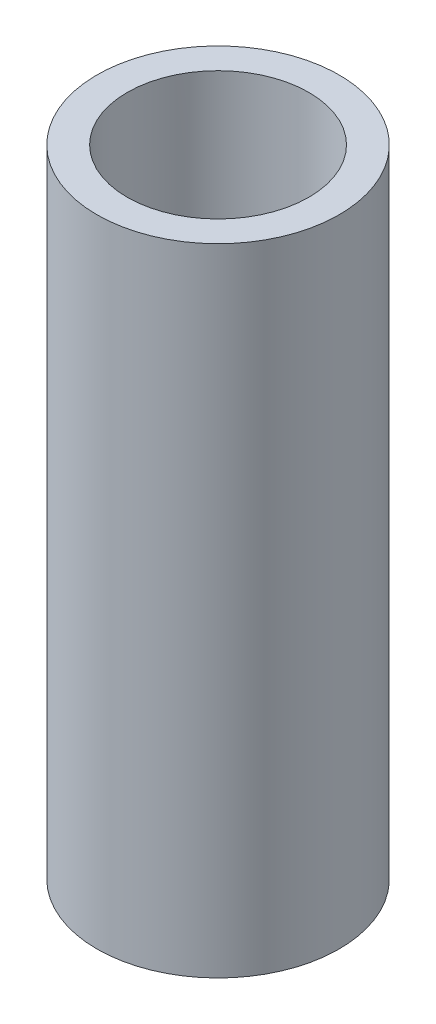
ISO-10303-21;
HEADER;
FILE_DESCRIPTION(('STEP AP214'),'2;1');
FILE_NAME('part.step','',(''),(''),'','','');
FILE_SCHEMA(('AUTOMOTIVE_DESIGN { 1 0 10303 214 1 1 1 1 }'));
ENDSEC;
DATA;
#1=APPLICATION_CONTEXT('core data for automotive mechanical design processes');
#2=APPLICATION_PROTOCOL_DEFINITION('international standard','automotive_design',2000,#1);
#3=PRODUCT_CONTEXT('',#1,'mechanical');
#4=PRODUCT('Part','Part','',(#3));
#5=PRODUCT_RELATED_PRODUCT_CATEGORY('part','',(#4));
#6=PRODUCT_DEFINITION_FORMATION('','',#4);
#7=PRODUCT_DEFINITION_CONTEXT('part definition',#1,'design');
#8=PRODUCT_DEFINITION('design','',#6,#7);
#9=PRODUCT_DEFINITION_SHAPE('','',#8);
#10=(LENGTH_UNIT() NAMED_UNIT(*) SI_UNIT(.MILLI.,.METRE.));
#11=(NAMED_UNIT(*) PLANE_ANGLE_UNIT() SI_UNIT($,.RADIAN.));
#12=(NAMED_UNIT(*) SI_UNIT($,.STERADIAN.) SOLID_ANGLE_UNIT());
#13=UNCERTAINTY_MEASURE_WITH_UNIT(LENGTH_MEASURE(1.E-05),#10,'distance_accuracy_value','');
#14=(GEOMETRIC_REPRESENTATION_CONTEXT(3) GLOBAL_UNCERTAINTY_ASSIGNED_CONTEXT((#13)) GLOBAL_UNIT_ASSIGNED_CONTEXT((#10,
#11,#12)) REPRESENTATION_CONTEXT('',''));
#15=CARTESIAN_POINT('',(0.,0.,0.));
#16=DIRECTION('',(0.,0.,1.));
#17=DIRECTION('',(1.,0.,0.));
#18=AXIS2_PLACEMENT_3D('',#15,#16,#17);
#19=CARTESIAN_POINT('',(0.,21.,0.));
#20=DIRECTION('',(0.,-1.,0.));
#21=DIRECTION('',(0.,0.,-1.));
#22=AXIS2_PLACEMENT_3D('',#19,#20,#21);
#23=CYLINDRICAL_SURFACE('',#22,4.);
#24=DIRECTION('',(0.,-1.,0.));
#25=VECTOR('',#24,1.);
#26=CARTESIAN_POINT('',(-3.99991645107305,21.,-0.0258531320189111));
#27=LINE('',#26,#25);
#28=CARTESIAN_POINT('',(-3.99991645107308,17.399761270919,-0.025853132018911));
#29=VERTEX_POINT('',#28);
#30=CARTESIAN_POINT('',(-3.99991645107308,14.600238729081,-0.025853132018911));
#31=VERTEX_POINT('',#30);
#32=EDGE_CURVE('E11',#29,#31,#27,.T.);
#33=ORIENTED_EDGE('',*,*,#32,.T.);
#34=CARTESIAN_POINT('',(-3.99991645107308,14.600238729081,-0.0258531320190421));
#35=CARTESIAN_POINT('',(-3.99967225830139,14.6009439988238,-0.0640921575293315));
#36=CARTESIAN_POINT('',(-3.99887347610365,14.6032187619792,-0.102278964228953));
#37=CARTESIAN_POINT('',(-3.99620499133585,14.6108738995903,-0.178292419562263));
#38=CARTESIAN_POINT('',(-3.99433556857381,14.6162534626206,-0.216119159673172));
#39=CARTESIAN_POINT('',(-3.98719610185074,14.6369488008378,-0.328422064505284));
#40=CARTESIAN_POINT('',(-3.98039240823535,14.6568271415164,-0.402013757078062));
#41=CARTESIAN_POINT('',(-3.96340813940453,14.7080320373958,-0.544576356502268));
#42=CARTESIAN_POINT('',(-3.95322930854667,14.7393526797706,-0.613549628185836));
#43=CARTESIAN_POINT('',(-3.93052020660311,14.8124834378182,-0.745307835813629));
#44=CARTESIAN_POINT('',(-3.91798857048058,14.8542996475161,-0.808089146927107));
#45=CARTESIAN_POINT('',(-3.89135352945277,14.9489240346771,-0.928050448785724));
#46=CARTESIAN_POINT('',(-3.8772106603566,15.0020634331421,-0.984960294435631));
#47=CARTESIAN_POINT('',(-3.84921378824501,15.1170764566808,-1.08925407411135));
#48=CARTESIAN_POINT('',(-3.83535986056662,15.1789523277724,-1.1366355509169));
#49=CARTESIAN_POINT('',(-3.80908699514521,15.3118854332206,-1.22184578759158));
#50=CARTESIAN_POINT('',(-3.79672101385227,15.3831561146456,-1.2593593716383));
#51=CARTESIAN_POINT('',(-3.77546131742445,15.5315120212514,-1.32173627746362));
#52=CARTESIAN_POINT('',(-3.76656616175619,15.6085948182841,-1.34660484873724));
#53=CARTESIAN_POINT('',(-3.75372261689463,15.7631109656046,-1.38199497149599));
#54=CARTESIAN_POINT('',(-3.74958979642407,15.840405738016,-1.39305292756278));
#55=CARTESIAN_POINT('',(-3.74619639341714,15.9958548095515,-1.40215536416123));
#56=CARTESIAN_POINT('',(-3.74693437342952,16.0740088482956,-1.40020368404321));
#57=CARTESIAN_POINT('',(-3.75302260858192,16.2249354068714,-1.38379454669174));
#58=CARTESIAN_POINT('',(-3.75814713768332,16.2977849538027,-1.36994900946075));
#59=CARTESIAN_POINT('',(-3.77208656020989,16.440062954669,-1.33108421220736));
#60=CARTESIAN_POINT('',(-3.78090196998585,16.5094909284095,-1.30606338874007));
#61=CARTESIAN_POINT('',(-3.8014547569224,16.6446909983725,-1.24498869082329));
#62=CARTESIAN_POINT('',(-3.81325163509311,16.7103504237503,-1.20870621983939));
#63=CARTESIAN_POINT('',(-3.83839332211351,16.8348584792766,-1.12631614578102));
#64=CARTESIAN_POINT('',(-3.85173858055954,16.8937051212682,-1.08020568572731));
#65=CARTESIAN_POINT('',(-3.87940616234065,17.0064550711861,-0.976347097309243));
#66=CARTESIAN_POINT('',(-3.89374063509772,17.0598814916565,-0.918083294265943));
#67=CARTESIAN_POINT('',(-3.92108981098457,17.156325832214,-0.79318088663264));
#68=CARTESIAN_POINT('',(-3.93410407430078,17.1993402902396,-0.726539507591292));
#69=CARTESIAN_POINT('',(-3.95748807810665,17.2739625280279,-0.586005200561402));
#70=CARTESIAN_POINT('',(-3.96783560070064,17.3054753314649,-0.51205802975848));
#71=CARTESIAN_POINT('',(-3.98454566226436,17.3554207033291,-0.359510885329969));
#72=CARTESIAN_POINT('',(-3.99091545014645,17.3738770736394,-0.280919662805801));
#73=CARTESIAN_POINT('',(-3.9963966045933,17.3896748938166,-0.172255891920458));
#74=CARTESIAN_POINT('',(-3.99754872485567,17.3929825667261,-0.143056897965824));
#75=CARTESIAN_POINT('',(-3.99921326658427,17.39775252398,-0.0845341011151192));
#76=CARTESIAN_POINT('',(-3.99972663497742,17.3992175400328,-0.0552105477894228));
#77=CARTESIAN_POINT('',(-3.99991645107305,17.399761270919,-0.0258531320190412));
#78=B_SPLINE_CURVE_WITH_KNOTS('',3,(#34,#35,#36,#37,#38,#39,#40,#41,#42,#43,#44,#45,#46,#47,#48,
#49,#50,#51,#52,#53,#54,#55,#56,#57,#58,#59,#60,#61,#62,#63,#64,#65,#66,#67,#68,#69,#70,#71,#72,
#73,#74,#75,#76,#77),.UNSPECIFIED.,.F.,.F.,(4,2,2,2,2,2,2,2,2,2,2,2,2,2,2,2,2,2,2,2,2,4),(0.,
0.114664507603254,0.229299061720669,0.457701131164789,0.685985340068443,0.9144024051538,
1.15074978367751,1.38715803462588,1.63038942015454,1.87351974714062,2.1068793264695,
2.34017004072909,2.56213147320374,2.78412396825833,3.01095516106762,3.23785238346189,
3.47775904339029,3.71774536497249,3.9596708177997,4.20115409590331,4.28932861164633,
4.37737225545862),.UNSPECIFIED.);
#79=EDGE_CURVE('E87',#31,#29,#78,.T.);
#80=ORIENTED_EDGE('',*,*,#79,.T.);
#81=EDGE_LOOP('',(#33,#80));
#82=FACE_BOUND('',#81,.T.);
#83=DIRECTION('',(0.,-1.,0.));
#84=VECTOR('',#83,1.);
#85=CARTESIAN_POINT('',(-3.99991645107305,21.,0.0258531320189111));
#86=LINE('',#85,#84);
#87=CARTESIAN_POINT('',(-3.99991645107308,14.600238729081,0.025853132018911));
#88=VERTEX_POINT('',#87);
#89=CARTESIAN_POINT('',(-3.99991645107308,17.399761270919,0.025853132018911));
#90=VERTEX_POINT('',#89);
#91=EDGE_CURVE('E48',#88,#90,#86,.F.);
#92=ORIENTED_EDGE('',*,*,#91,.T.);
#93=CARTESIAN_POINT('',(-3.99991645107308,17.399761270919,0.0258531320190421));
#94=CARTESIAN_POINT('',(-3.99967225830139,17.3990560011763,0.0640921575293312));
#95=CARTESIAN_POINT('',(-3.99887347610365,17.3967812380208,0.102278964228953));
#96=CARTESIAN_POINT('',(-3.99620499133585,17.3891261004098,0.178292419562263));
#97=CARTESIAN_POINT('',(-3.99433556857381,17.3837465373795,0.216119159673172));
#98=CARTESIAN_POINT('',(-3.98719610185074,17.3630511991623,0.328422064505283));
#99=CARTESIAN_POINT('',(-3.98039240823535,17.3431728584837,0.40201375707806));
#100=CARTESIAN_POINT('',(-3.96340813940453,17.2919679626042,0.544576356502268));
#101=CARTESIAN_POINT('',(-3.95322930854667,17.2606473202295,0.613549628185838));
#102=CARTESIAN_POINT('',(-3.93052020660311,17.1875165621819,0.74530783581363));
#103=CARTESIAN_POINT('',(-3.91798857048058,17.145700352484,0.808089146927105));
#104=CARTESIAN_POINT('',(-3.89135352945277,17.051075965323,0.928050448785722));
#105=CARTESIAN_POINT('',(-3.8772106603566,16.997936566858,0.98496029443563));
#106=CARTESIAN_POINT('',(-3.84921378824501,16.8829235433193,1.08925407411135));
#107=CARTESIAN_POINT('',(-3.83535986056663,16.8210476722277,1.13663555091689));
#108=CARTESIAN_POINT('',(-3.80908699514521,16.6881145667794,1.22184578759158));
#109=CARTESIAN_POINT('',(-3.79672101385227,16.6168438853544,1.25935937163829));
#110=CARTESIAN_POINT('',(-3.77546131742445,16.4684879787486,1.32173627746362));
#111=CARTESIAN_POINT('',(-3.76656616175619,16.391405181716,1.34660484873724));
#112=CARTESIAN_POINT('',(-3.75372261689463,16.2368890343955,1.38199497149599));
#113=CARTESIAN_POINT('',(-3.74958979642407,16.1595942619841,1.39305292756278));
#114=CARTESIAN_POINT('',(-3.74619639341714,16.0041451904485,1.40215536416123));
#115=CARTESIAN_POINT('',(-3.74693437342952,15.9259911517045,1.40020368404321));
#116=CARTESIAN_POINT('',(-3.75302260858192,15.7750645931286,1.38379454669174));
#117=CARTESIAN_POINT('',(-3.75814713768331,15.7022150461974,1.36994900946075));
#118=CARTESIAN_POINT('',(-3.77208656020989,15.5599370453311,1.33108421220736));
#119=CARTESIAN_POINT('',(-3.78090196998585,15.4905090715906,1.30606338874007));
#120=CARTESIAN_POINT('',(-3.8014547569224,15.3553090016275,1.24498869082329));
#121=CARTESIAN_POINT('',(-3.81325163509311,15.2896495762497,1.20870621983939));
#122=CARTESIAN_POINT('',(-3.83839332211351,15.1651415207234,1.12631614578102));
#123=CARTESIAN_POINT('',(-3.85173858055954,15.1062948787318,1.0802056857273));
#124=CARTESIAN_POINT('',(-3.87940616234065,14.993544928814,0.976347097309244));
#125=CARTESIAN_POINT('',(-3.89374063509773,14.9401185083435,0.918083294265944));
#126=CARTESIAN_POINT('',(-3.92108981098458,14.8436741677861,0.79318088663264));
#127=CARTESIAN_POINT('',(-3.93410407430078,14.8006597097605,0.726539507591293));
#128=CARTESIAN_POINT('',(-3.95748807810665,14.7260374719722,0.586005200561404));
#129=CARTESIAN_POINT('',(-3.96783560070064,14.6945246685351,0.512058029758483));
#130=CARTESIAN_POINT('',(-3.98454566226436,14.644579296671,0.359510885329972));
#131=CARTESIAN_POINT('',(-3.99091545014645,14.6261229263606,0.280919662805803));
#132=CARTESIAN_POINT('',(-3.9963966045933,14.6103251061834,0.17225589192046));
#133=CARTESIAN_POINT('',(-3.99754872485567,14.607017433274,0.143056897965826));
#134=CARTESIAN_POINT('',(-3.99921326658427,14.6022474760201,0.0845341011151206));
#135=CARTESIAN_POINT('',(-3.99972663497742,14.6007824599673,0.0552105477894235));
#136=CARTESIAN_POINT('',(-3.99991645107305,14.600238729081,0.0258531320190412));
#137=B_SPLINE_CURVE_WITH_KNOTS('',3,(#93,#94,#95,#96,#97,#98,#99,#100,#101,#102,#103,#104,#105,
#106,#107,#108,#109,#110,#111,#112,#113,#114,#115,#116,#117,#118,#119,#120,#121,#122,#123,#124,
#125,#126,#127,#128,#129,#130,#131,#132,#133,#134,#135,#136),.UNSPECIFIED.,.F.,.F.,(4,2,2,2,2,2,
2,2,2,2,2,2,2,2,2,2,2,2,2,2,2,4),(0.,0.114664507603254,0.229299061720668,0.457701131164788,
0.685985340068446,0.914402405153799,1.15074978367751,1.38715803462588,1.63038942015453,
1.87351974714062,2.1068793264695,2.34017004072909,2.56213147320374,2.78412396825833,
3.01095516106763,3.23785238346189,3.4777590433903,3.71774536497248,3.95967081779969,
4.20115409590331,4.28932861164633,4.37737225545862),.UNSPECIFIED.);
#138=EDGE_CURVE('E85',#90,#88,#137,.T.);
#139=ORIENTED_EDGE('',*,*,#138,.T.);
#140=EDGE_LOOP('',(#92,#139));
#141=FACE_BOUND('',#140,.T.);
#142=DIRECTION('',(0.,-1.,0.));
#143=VECTOR('',#142,1.);
#144=CARTESIAN_POINT('',(-3.99991645107305,21.,-0.0258531320189111));
#145=LINE('',#144,#143);
#146=CARTESIAN_POINT('',(-3.99991645107316,6.39976127091904,-0.025853132018911));
#147=VERTEX_POINT('',#146);
#148=CARTESIAN_POINT('',(-3.99991645107316,3.60023872908101,-0.025853132018911));
#149=VERTEX_POINT('',#148);
#150=EDGE_CURVE('E82',#147,#149,#145,.T.);
#151=ORIENTED_EDGE('',*,*,#150,.T.);
#152=CARTESIAN_POINT('',(-3.99991645107316,3.60023872908101,-0.0258531320189111));
#153=CARTESIAN_POINT('',(-3.99967225830142,3.60094399882377,-0.0640921575291983));
#154=CARTESIAN_POINT('',(-3.99887347610366,3.6032187619792,-0.102278964228819));
#155=CARTESIAN_POINT('',(-3.99620499133584,3.61087389959025,-0.178292419562128));
#156=CARTESIAN_POINT('',(-3.99433556857381,3.61625346262055,-0.216119159673037));
#157=CARTESIAN_POINT('',(-3.98719610185076,3.63694880083776,-0.328422064505149));
#158=CARTESIAN_POINT('',(-3.98039240823537,3.65682714151634,-0.402013757077929));
#159=CARTESIAN_POINT('',(-3.96340813940455,3.70803203739579,-0.544576356502139));
#160=CARTESIAN_POINT('',(-3.95322930854669,3.73935267977053,-0.61354962818571));
#161=CARTESIAN_POINT('',(-3.93052020660313,3.81248343781812,-0.745307835813509));
#162=CARTESIAN_POINT('',(-3.91798857048061,3.854299647516,-0.808089146926989));
#163=CARTESIAN_POINT('',(-3.8913535294528,3.94892403467695,-0.928050448785614));
#164=CARTESIAN_POINT('',(-3.87721066035663,4.00206343314195,-0.984960294435526));
#165=CARTESIAN_POINT('',(-3.84921378824504,4.11707645668067,-1.08925407411126));
#166=CARTESIAN_POINT('',(-3.83535986056665,4.17895232777225,-1.13663555091681));
#167=CARTESIAN_POINT('',(-3.80908699514523,4.31188543322051,-1.2218457875915));
#168=CARTESIAN_POINT('',(-3.79672101385229,4.38315611464547,-1.25935937163823));
#169=CARTESIAN_POINT('',(-3.77546131742447,4.53151202125127,-1.32173627746357));
#170=CARTESIAN_POINT('',(-3.76656616175621,4.60859481828395,-1.3466048487372));
#171=CARTESIAN_POINT('',(-3.75372261689464,4.76311096560443,-1.38199497149597));
#172=CARTESIAN_POINT('',(-3.74958979642408,4.84040573801585,-1.39305292756276));
#173=CARTESIAN_POINT('',(-3.74619639341714,4.99585480955136,-1.40215536416123));
#174=CARTESIAN_POINT('',(-3.74693437342952,5.07400884829543,-1.40020368404322));
#175=CARTESIAN_POINT('',(-3.75302260858191,5.22493540687129,-1.38379454669176));
#176=CARTESIAN_POINT('',(-3.7581471376833,5.29778495380255,-1.36994900946078));
#177=CARTESIAN_POINT('',(-3.77208656020987,5.44006295466883,-1.33108421220741));
#178=CARTESIAN_POINT('',(-3.78090196998583,5.50949092840937,-1.30606338874012));
#179=CARTESIAN_POINT('',(-3.80145475692238,5.6446909983724,-1.24498869082335));
#180=CARTESIAN_POINT('',(-3.81325163509309,5.71035042375019,-1.20870621983946));
#181=CARTESIAN_POINT('',(-3.83839332211348,5.83485847927652,-1.12631614578111));
#182=CARTESIAN_POINT('',(-3.85173858055951,5.8937051212681,-1.0802056857274));
#183=CARTESIAN_POINT('',(-3.87940616234062,6.00645507118598,-0.976347097309352));
#184=CARTESIAN_POINT('',(-3.8937406350977,6.05988149165643,-0.918083294266058));
#185=CARTESIAN_POINT('',(-3.92108981098455,6.15632583221387,-0.793180886632766));
#186=CARTESIAN_POINT('',(-3.93410407430075,6.19934029023948,-0.726539507591425));
#187=CARTESIAN_POINT('',(-3.95748807810663,6.27396252802781,-0.586005200561544));
#188=CARTESIAN_POINT('',(-3.96783560070062,6.30547533146489,-0.512058029758626));
#189=CARTESIAN_POINT('',(-3.98454566226434,6.35542070332904,-0.359510885330119));
#190=CARTESIAN_POINT('',(-3.99091545014644,6.37387707363939,-0.280919662805951));
#191=CARTESIAN_POINT('',(-3.9963966045933,6.3896748938166,-0.172255891920562));
#192=CARTESIAN_POINT('',(-3.99754872485567,6.3929825667261,-0.14305689796588));
#193=CARTESIAN_POINT('',(-3.99921326658427,6.39775252397999,-0.0845341011150808));
#194=CARTESIAN_POINT('',(-3.99972663497742,6.39921754003277,-0.0552105477893363));
#195=CARTESIAN_POINT('',(-3.99991645107305,6.39976127091905,-0.0258531320189066));
#196=B_SPLINE_CURVE_WITH_KNOTS('',3,(#152,#153,#154,#155,#156,#157,#158,#159,#160,#161,#162,
#163,#164,#165,#166,#167,#168,#169,#170,#171,#172,#173,#174,#175,#176,#177,#178,#179,#180,#181,
#182,#183,#184,#185,#186,#187,#188,#189,#190,#191,#192,#193,#194,#195),.UNSPECIFIED.,.F.,.F.,(4,
2,2,2,2,2,2,2,2,2,2,2,2,2,2,2,2,2,2,2,2,4),(0.,0.114664507603251,0.229299061720663,
0.457701131164782,0.685985340068434,0.914402405153786,1.15074978367749,1.38715803462586,
1.63038942015451,1.8735197471406,2.10687932646949,2.34017004072907,2.56213147320373,
2.78412396825832,3.01095516106761,3.23785238346187,3.47775904339027,3.71774536497246,
3.95967081779967,4.20115409590329,4.28932861164646,4.37737225545889),.UNSPECIFIED.);
#197=EDGE_CURVE('E177',#149,#147,#196,.T.);
#198=ORIENTED_EDGE('',*,*,#197,.T.);
#199=EDGE_LOOP('',(#151,#198));
#200=FACE_BOUND('',#199,.T.);
#201=DIRECTION('',(0.,-1.,0.));
#202=VECTOR('',#201,1.);
#203=CARTESIAN_POINT('',(-3.99991645107305,21.,0.0258531320189111));
#204=LINE('',#203,#202);
#205=CARTESIAN_POINT('',(-3.99991645107316,3.60023872908101,0.025853132018911));
#206=VERTEX_POINT('',#205);
#207=CARTESIAN_POINT('',(-3.99991645107316,6.39976127091904,0.025853132018911));
#208=VERTEX_POINT('',#207);
#209=EDGE_CURVE('E182',#206,#208,#204,.F.);
#210=ORIENTED_EDGE('',*,*,#209,.T.);
#211=CARTESIAN_POINT('',(-3.99991645107316,6.39976127091904,0.0258531320189111));
#212=CARTESIAN_POINT('',(-3.99967225830142,6.39905600117628,0.0640921575291982));
#213=CARTESIAN_POINT('',(-3.99887347610366,6.39678123802085,0.102278964228819));
#214=CARTESIAN_POINT('',(-3.99620499133584,6.38912610040981,0.178292419562127));
#215=CARTESIAN_POINT('',(-3.99433556857381,6.38374653737951,0.216119159673036));
#216=CARTESIAN_POINT('',(-3.98719610185076,6.3630511991623,0.328422064505149));
#217=CARTESIAN_POINT('',(-3.98039240823537,6.34317285848372,0.402013757077927));
#218=CARTESIAN_POINT('',(-3.96340813940455,6.29196796260427,0.544576356502137));
#219=CARTESIAN_POINT('',(-3.95322930854669,6.26064732022953,0.613549628185708));
#220=CARTESIAN_POINT('',(-3.93052020660313,6.18751656218193,0.745307835813506));
#221=CARTESIAN_POINT('',(-3.9179885704806,6.14570035248406,0.808089146926986));
#222=CARTESIAN_POINT('',(-3.8913535294528,6.0510759653231,0.928050448785611));
#223=CARTESIAN_POINT('',(-3.87721066035663,5.99793656685811,0.984960294435523));
#224=CARTESIAN_POINT('',(-3.84921378824504,5.88292354331939,1.08925407411126));
#225=CARTESIAN_POINT('',(-3.83535986056665,5.82104767222781,1.1366355509168));
#226=CARTESIAN_POINT('',(-3.80908699514524,5.68811456677954,1.2218457875915));
#227=CARTESIAN_POINT('',(-3.79672101385229,5.61684388535459,1.25935937163823));
#228=CARTESIAN_POINT('',(-3.77546131742447,5.46848797874879,1.32173627746357));
#229=CARTESIAN_POINT('',(-3.76656616175621,5.39140518171611,1.3466048487372));
#230=CARTESIAN_POINT('',(-3.75372261689464,5.23688903439562,1.38199497149597));
#231=CARTESIAN_POINT('',(-3.74958979642408,5.1595942619842,1.39305292756276));
#232=CARTESIAN_POINT('',(-3.74619639341714,5.00414519044869,1.40215536416123));
#233=CARTESIAN_POINT('',(-3.74693437342952,4.92599115170463,1.40020368404322));
#234=CARTESIAN_POINT('',(-3.75302260858191,4.77506459312876,1.38379454669176));
#235=CARTESIAN_POINT('',(-3.7581471376833,4.70221504619751,1.36994900946078));
#236=CARTESIAN_POINT('',(-3.77208656020987,4.55993704533122,1.33108421220741));
#237=CARTESIAN_POINT('',(-3.78090196998583,4.49050907159068,1.30606338874012));
#238=CARTESIAN_POINT('',(-3.80145475692238,4.35530900162765,1.24498869082335));
#239=CARTESIAN_POINT('',(-3.81325163509309,4.28964957624987,1.20870621983946));
#240=CARTESIAN_POINT('',(-3.83839332211348,4.16514152072353,1.12631614578111));
#241=CARTESIAN_POINT('',(-3.85173858055951,4.10629487873195,1.0802056857274));
#242=CARTESIAN_POINT('',(-3.87940616234062,3.99354492881407,0.976347097309353));
#243=CARTESIAN_POINT('',(-3.8937406350977,3.94011850834362,0.918083294266059));
#244=CARTESIAN_POINT('',(-3.92108981098455,3.84367416778618,0.793180886632768));
#245=CARTESIAN_POINT('',(-3.93410407430075,3.80065970976057,0.726539507591427));
#246=CARTESIAN_POINT('',(-3.95748807810663,3.72603747197224,0.586005200561547));
#247=CARTESIAN_POINT('',(-3.96783560070062,3.69452466853517,0.512058029758628));
#248=CARTESIAN_POINT('',(-3.98454566226434,3.64457929667102,0.359510885330122));
#249=CARTESIAN_POINT('',(-3.99091545014644,3.62612292636067,0.280919662805955));
#250=CARTESIAN_POINT('',(-3.9963966045933,3.61032510618346,0.172255891920565));
#251=CARTESIAN_POINT('',(-3.99754872485567,3.60701743327396,0.143056897965883));
#252=CARTESIAN_POINT('',(-3.99921326658427,3.60224747602007,0.0845341011150814));
#253=CARTESIAN_POINT('',(-3.99972663497742,3.60078245996728,0.0552105477893365));
#254=CARTESIAN_POINT('',(-3.99991645107305,3.60023872908101,0.0258531320189065));
#255=B_SPLINE_CURVE_WITH_KNOTS('',3,(#211,#212,#213,#214,#215,#216,#217,#218,#219,#220,#221,
#222,#223,#224,#225,#226,#227,#228,#229,#230,#231,#232,#233,#234,#235,#236,#237,#238,#239,#240,
#241,#242,#243,#244,#245,#246,#247,#248,#249,#250,#251,#252,#253,#254),.UNSPECIFIED.,.F.,.F.,(4,
2,2,2,2,2,2,2,2,2,2,2,2,2,2,2,2,2,2,2,2,4),(0.,0.114664507603251,0.229299061720663,
0.457701131164781,0.685985340068431,0.914402405153782,1.15074978367749,1.38715803462585,
1.63038942015451,1.8735197471406,2.10687932646949,2.34017004072907,2.56213147320373,
2.78412396825832,3.01095516106761,3.23785238346187,3.47775904339027,3.71774536497246,
3.95967081779967,4.20115409590329,4.28932861164646,4.37737225545889),.UNSPECIFIED.);
#256=EDGE_CURVE('E174',#208,#206,#255,.T.);
#257=ORIENTED_EDGE('',*,*,#256,.T.);
#258=EDGE_LOOP('',(#210,#257));
#259=FACE_BOUND('',#258,.T.);
#260=CARTESIAN_POINT('',(0.,21.,0.));
#261=DIRECTION('',(0.,1.,0.));
#262=DIRECTION('',(0.,0.,1.));
#263=AXIS2_PLACEMENT_3D('',#260,#261,#262);
#264=CIRCLE('',#263,4.);
#265=CARTESIAN_POINT('',(0.,21.,4.));
#266=VERTEX_POINT('',#265);
#267=EDGE_CURVE('E222',#266,#266,#264,.T.);
#268=ORIENTED_EDGE('',*,*,#267,.F.);
#269=EDGE_LOOP('',(#268));
#270=FACE_BOUND('',#269,.T.);
#271=CARTESIAN_POINT('',(0.,0.,0.));
#272=DIRECTION('',(0.,1.,0.));
#273=DIRECTION('',(0.,0.,1.));
#274=AXIS2_PLACEMENT_3D('',#271,#272,#273);
#275=CIRCLE('',#274,4.);
#276=CARTESIAN_POINT('',(0.,0.,4.));
#277=VERTEX_POINT('',#276);
#278=EDGE_CURVE('E128',#277,#277,#275,.T.);
#279=ORIENTED_EDGE('',*,*,#278,.T.);
#280=EDGE_LOOP('',(#279));
#281=FACE_BOUND('',#280,.T.);
#282=ADVANCED_FACE('F39',(#82,#141,#200,#259,#270,#281),#23,.T.);
#283=CARTESIAN_POINT('',(0.,21.,0.));
#284=DIRECTION('',(0.,1.,0.));
#285=DIRECTION('',(0.,0.,1.));
#286=AXIS2_PLACEMENT_3D('',#283,#284,#285);
#287=PLANE('',#286);
#288=CARTESIAN_POINT('',(0.,21.,0.));
#289=DIRECTION('',(0.,1.,0.));
#290=DIRECTION('',(0.,0.,1.));
#291=AXIS2_PLACEMENT_3D('',#288,#289,#290);
#292=CIRCLE('',#291,3.);
#293=CARTESIAN_POINT('',(0.,21.,3.));
#294=VERTEX_POINT('',#293);
#295=EDGE_CURVE('E186',#294,#294,#292,.T.);
#296=ORIENTED_EDGE('',*,*,#295,.F.);
#297=EDGE_LOOP('',(#296));
#298=FACE_BOUND('',#297,.T.);
#299=ORIENTED_EDGE('',*,*,#267,.T.);
#300=EDGE_LOOP('',(#299));
#301=FACE_BOUND('',#300,.T.);
#302=ADVANCED_FACE('F151',(#298,#301),#287,.T.);
#303=CARTESIAN_POINT('',(0.,0.,0.));
#304=DIRECTION('',(0.,1.,0.));
#305=DIRECTION('',(0.,0.,1.));
#306=AXIS2_PLACEMENT_3D('',#303,#304,#305);
#307=PLANE('',#306);
#308=CARTESIAN_POINT('',(0.,0.,0.));
#309=DIRECTION('',(0.,-1.,0.));
#310=DIRECTION('',(0.,0.,-1.));
#311=AXIS2_PLACEMENT_3D('',#308,#309,#310);
#312=CIRCLE('',#311,3.);
#313=CARTESIAN_POINT('',(0.,0.,-3.));
#314=VERTEX_POINT('',#313);
#315=EDGE_CURVE('E213',#314,#314,#312,.T.);
#316=ORIENTED_EDGE('',*,*,#315,.F.);
#317=EDGE_LOOP('',(#316));
#318=FACE_BOUND('',#317,.T.);
#319=ORIENTED_EDGE('',*,*,#278,.F.);
#320=EDGE_LOOP('',(#319));
#321=FACE_BOUND('',#320,.T.);
#322=ADVANCED_FACE('F149',(#318,#321),#307,.F.);
#323=CARTESIAN_POINT('',(0.,10.,0.));
#324=DIRECTION('',(0.,-1.,0.));
#325=DIRECTION('',(0.,0.,-1.));
#326=AXIS2_PLACEMENT_3D('',#323,#324,#325);
#327=CYLINDRICAL_SURFACE('',#326,3.);
#328=CARTESIAN_POINT('',(-3.,3.60000000000002,0.));
#329=CARTESIAN_POINT('',(-2.9999965985567,3.60000405055415,0.0741760141958531));
#330=CARTESIAN_POINT('',(-2.99721866421499,3.6059298208353,0.148457438343158));
#331=CARTESIAN_POINT('',(-2.98638133101226,3.62938775927337,0.294860958042639));
#332=CARTESIAN_POINT('',(-2.97831023303417,3.646945637961,0.366977899485661));
#333=CARTESIAN_POINT('',(-2.95773878056305,3.69285175513391,0.506705207958355));
#334=CARTESIAN_POINT('',(-2.94525483671525,3.7211600432343,0.574331184032727));
#335=CARTESIAN_POINT('',(-2.91703179641225,3.78757430069872,0.703790652559757));
#336=CARTESIAN_POINT('',(-2.90129324579851,3.82567862739523,0.765625113804209));
#337=CARTESIAN_POINT('',(-2.86703510505487,3.91299068367757,0.885556018232681));
#338=CARTESIAN_POINT('',(-2.84841047078529,3.96269183926661,0.943262854198597));
#339=CARTESIAN_POINT('',(-2.81086626705385,4.07073418715408,1.04987206669058));
#340=CARTESIAN_POINT('',(-2.79194651225135,4.12908102206134,1.09876864666266));
#341=CARTESIAN_POINT('',(-2.75454886272565,4.25734367229925,1.18954928643585));
#342=CARTESIAN_POINT('',(-2.73618026181933,4.3277658265075,1.23076801131511));
#343=CARTESIAN_POINT('',(-2.70368671328043,4.47550833416624,1.30060459631542));
#344=CARTESIAN_POINT('',(-2.68955905843085,4.55282424590698,1.32923050054668));
#345=CARTESIAN_POINT('',(-2.66831280778357,4.70770866918582,1.37136389166292));
#346=CARTESIAN_POINT('',(-2.66084688805232,4.78502201339796,1.38562630954338));
#347=CARTESIAN_POINT('',(-2.65280653141493,4.94127615546872,1.4009643178012));
#348=CARTESIAN_POINT('',(-2.65222672171534,5.02021563637319,1.4020501890138));
#349=CARTESIAN_POINT('',(-2.6577381391041,5.16895217740734,1.39156325474428));
#350=CARTESIAN_POINT('',(-2.66316277668237,5.23886867632523,1.38125548710099));
#351=CARTESIAN_POINT('',(-2.67892103840313,5.37583407839284,1.35043639237287));
#352=CARTESIAN_POINT('',(-2.68925592410991,5.44288223976728,1.32992244300339));
#353=CARTESIAN_POINT('',(-2.71390923378543,5.57407219133116,1.27887161255287));
#354=CARTESIAN_POINT('',(-2.7283140240837,5.6381113040015,1.24811450695909));
#355=CARTESIAN_POINT('',(-2.75947702819645,5.76040599635071,1.17761205733664));
#356=CARTESIAN_POINT('',(-2.77623626923161,5.81865903259066,1.13786278548149));
#357=CARTESIAN_POINT('',(-2.81242518177222,5.93438674275869,1.04545769592096));
#358=CARTESIAN_POINT('',(-2.83194722846672,5.9910901886705,0.991869135627384));
#359=CARTESIAN_POINT('',(-2.86996272516678,6.09500116110055,0.875809338201001));
#360=CARTESIAN_POINT('',(-2.88845579691007,6.14220521200857,0.813334864133947));
#361=CARTESIAN_POINT('',(-2.92314231667083,6.22732525800994,0.678420066791912));
#362=CARTESIAN_POINT('',(-2.9392303997136,6.26485056046578,0.60570404390301));
#363=CARTESIAN_POINT('',(-2.9664385628126,6.32685271851113,0.454047875045106));
#364=CARTESIAN_POINT('',(-2.97756209480586,6.3513386428982,0.375112098848905));
#365=CARTESIAN_POINT('',(-2.99289168727817,6.38477538548633,0.219630179590063));
#366=CARTESIAN_POINT('',(-2.99755511855446,6.39475615775339,0.143350867486888));
#367=CARTESIAN_POINT('',(-3.00096130674055,6.40206333991957,-0.00993159603062681));
#368=CARTESIAN_POINT('',(-2.99970636153703,6.39939466113063,-0.086934454931005));
#369=CARTESIAN_POINT('',(-2.99169876992405,6.38214022774374,-0.234138662301146));
#370=CARTESIAN_POINT('',(-2.98531143610107,6.36834612072599,-0.304455247280262));
#371=CARTESIAN_POINT('',(-2.9681169868393,6.33041470352996,-0.441661374952197));
#372=CARTESIAN_POINT('',(-2.95730935403885,6.30627618260254,-0.508550515457682));
#373=CARTESIAN_POINT('',(-2.93186182190092,6.2476106001117,-0.639346310572958));
#374=CARTESIAN_POINT('',(-2.91711463217098,6.21278785001445,-0.703098749779367));
#375=CARTESIAN_POINT('',(-2.88527461622476,6.13406557294699,-0.824081336424186));
#376=CARTESIAN_POINT('',(-2.86818076040266,6.09016205745981,-0.881308600637791));
#377=CARTESIAN_POINT('',(-2.83157928041133,5.99004942191815,-0.992927203863405));
#378=CARTESIAN_POINT('',(-2.81199150907127,5.93309825330475,-1.04662821994276));
#379=CARTESIAN_POINT('',(-2.7738171204936,5.81082205285308,-1.14397488618524));
#380=CARTESIAN_POINT('',(-2.7552309844915,5.74549304593618,-1.18761573536872));
#381=CARTESIAN_POINT('',(-2.72065279755534,5.60554626123672,-1.26487258942863));
#382=CARTESIAN_POINT('',(-2.70476441122083,5.53069596703142,-1.29811762077689));
#383=CARTESIAN_POINT('',(-2.67864935946574,5.37547393770382,-1.35119476914698));
#384=CARTESIAN_POINT('',(-2.6684164320798,5.29510842060298,-1.37104172650419));
#385=CARTESIAN_POINT('',(-2.65589863089785,5.13892445228561,-1.39512361569359));
#386=CARTESIAN_POINT('',(-2.65298045006346,5.06334913926896,-1.40060458275626));
#387=CARTESIAN_POINT('',(-2.65367487263324,4.91234617673002,-1.39928993042139));
#388=CARTESIAN_POINT('',(-2.65728564169681,4.83691849169113,-1.39249775922279));
#389=CARTESIAN_POINT('',(-2.66999487603889,4.69409993751636,-1.36795238910772));
#390=CARTESIAN_POINT('',(-2.67867409395688,4.62652404070424,-1.35103435582632));
#391=CARTESIAN_POINT('',(-2.70011439829818,4.49520171539723,-1.30765598987226));
#392=CARTESIAN_POINT('',(-2.71287670048705,4.43145643421731,-1.28119281477063));
#393=CARTESIAN_POINT('',(-2.74208602331761,4.30496345494762,-1.21748406199402));
#394=CARTESIAN_POINT('',(-2.75872111955289,4.24256152237861,-1.1796403806501));
#395=CARTESIAN_POINT('',(-2.79340714138716,4.12461018555878,-1.0949742620724));
#396=CARTESIAN_POINT('',(-2.81145872568485,4.06906400064616,-1.04814763276814));
#397=CARTESIAN_POINT('',(-2.8491150891186,3.96062638000435,-0.941307680520032));
#398=CARTESIAN_POINT('',(-2.86869394428718,3.90856074128222,-0.880442612871035));
#399=CARTESIAN_POINT('',(-2.90547332461736,3.81525656714879,-0.75019908647708));
#400=CARTESIAN_POINT('',(-2.92267271652822,3.77402318239519,-0.680816600685457));
#401=CARTESIAN_POINT('',(-2.95272548252542,3.70401250201676,-0.535611024288789));
#402=CARTESIAN_POINT('',(-2.96560157678301,3.67516985833646,-0.459824309977943));
#403=CARTESIAN_POINT('',(-2.98560363061672,3.6309772564507,-0.303822742627251));
#404=CARTESIAN_POINT('',(-2.99274669700571,3.6155871448256,-0.223621832238218));
#405=CARTESIAN_POINT('',(-2.99773444736987,3.60486098542434,-0.118989792805179));
#406=CARTESIAN_POINT('',(-2.99858232619917,3.60304009998086,-0.0952397688918339));
#407=CARTESIAN_POINT('',(-2.99971565466794,3.60060894435004,-0.047663459625105));
#408=CARTESIAN_POINT('',(-3.00000109308639,3.59999869831565,-0.0238371727597297));
#409=CARTESIAN_POINT('',(-3.,3.60000000000002,0.));
#410=B_SPLINE_CURVE_WITH_KNOTS('',3,(#328,#329,#330,#331,#332,#333,#334,#335,#336,#337,#338,
#339,#340,#341,#342,#343,#344,#345,#346,#347,#348,#349,#350,#351,#352,#353,#354,#355,#356,#357,
#358,#359,#360,#361,#362,#363,#364,#365,#366,#367,#368,#369,#370,#371,#372,#373,#374,#375,#376,
#377,#378,#379,#380,#381,#382,#383,#384,#385,#386,#387,#388,#389,#390,#391,#392,#393,#394,#395,
#396,#397,#398,#399,#400,#401,#402,#403,#404,#405,#406,#407,#408,#409),.UNSPECIFIED.,.T.,.F.,(4,
2,2,2,2,2,2,2,2,2,2,2,2,2,2,2,2,2,2,2,2,2,2,2,2,2,2,2,2,2,2,2,2,2,2,2,2,2,2,2,4),(0.,
0.222430614227101,0.445354516020345,0.667457974459498,0.889524213319484,1.12374008349084,
1.3581094936473,1.60776429290693,1.8572593839249,2.09282314699248,2.32820310256044,
2.53985531348055,2.75156193252273,2.96815060600377,3.18483406988205,3.42504393482463,
3.66534152788207,3.91419776760519,4.16288070273416,4.392858842168,4.62274769694935,
4.83758576938905,5.05244899415581,5.27389671638204,5.49544191175845,5.73644174754947,
5.97755635787823,6.2264897623231,6.47514698203737,6.70138965858242,6.92756878101078,
7.13725924988263,7.34701221368889,7.57065894835865,7.79441030722339,8.0406156991707,
8.28693794895593,8.53194466707524,8.7762175616393,8.84769634435319,8.9191765530954),.UNSPECIFIED.);
#411=CARTESIAN_POINT('',(-3.,3.60000000000002,0.));
#412=VERTEX_POINT('',#411);
#413=EDGE_CURVE('E97',#412,#412,#410,.T.);
#414=ORIENTED_EDGE('',*,*,#413,.T.);
#415=EDGE_LOOP('',(#414));
#416=FACE_BOUND('',#415,.T.);
#417=CARTESIAN_POINT('',(0.,10.,0.));
#418=DIRECTION('',(0.,-1.,0.));
#419=DIRECTION('',(0.,0.,-1.));
#420=AXIS2_PLACEMENT_3D('',#417,#418,#419);
#421=CIRCLE('',#420,3.);
#422=CARTESIAN_POINT('',(0.,10.,-3.));
#423=VERTEX_POINT('',#422);
#424=EDGE_CURVE('E211',#423,#423,#421,.T.);
#425=ORIENTED_EDGE('',*,*,#424,.F.);
#426=EDGE_LOOP('',(#425));
#427=FACE_BOUND('',#426,.T.);
#428=ORIENTED_EDGE('',*,*,#315,.T.);
#429=EDGE_LOOP('',(#428));
#430=FACE_BOUND('',#429,.T.);
#431=ADVANCED_FACE('F144',(#416,#427,#430),#327,.F.);
#432=CARTESIAN_POINT('',(0.,10.,0.));
#433=DIRECTION('',(0.,-1.,0.));
#434=DIRECTION('',(0.,0.,-1.));
#435=AXIS2_PLACEMENT_3D('',#432,#433,#434);
#436=PLANE('',#435);
#437=ORIENTED_EDGE('',*,*,#424,.T.);
#438=EDGE_LOOP('',(#437));
#439=FACE_BOUND('',#438,.T.);
#440=ADVANCED_FACE('F141',(#439),#436,.T.);
#441=CARTESIAN_POINT('',(0.,11.,0.));
#442=DIRECTION('',(0.,1.,0.));
#443=DIRECTION('',(0.,0.,1.));
#444=AXIS2_PLACEMENT_3D('',#441,#442,#443);
#445=CYLINDRICAL_SURFACE('',#444,3.);
#446=CARTESIAN_POINT('',(-3.,14.6,0.));
#447=CARTESIAN_POINT('',(-2.9999965985567,14.6000040505541,0.0741760141958531));
#448=CARTESIAN_POINT('',(-2.99721866421499,14.6059298208353,0.148457438343158));
#449=CARTESIAN_POINT('',(-2.98638133101226,14.6293877592734,0.29486095804264));
#450=CARTESIAN_POINT('',(-2.97831023303417,14.646945637961,0.366977899485662));
#451=CARTESIAN_POINT('',(-2.95773878056305,14.6928517551339,0.506705207958355));
#452=CARTESIAN_POINT('',(-2.94525483671525,14.7211600432343,0.574331184032727));
#453=CARTESIAN_POINT('',(-2.91703179641225,14.7875743006987,0.703790652559757));
#454=CARTESIAN_POINT('',(-2.90129324579851,14.8256786273952,0.765625113804209));
#455=CARTESIAN_POINT('',(-2.86703510505487,14.9129906836776,0.88555601823268));
#456=CARTESIAN_POINT('',(-2.84841047078529,14.9626918392666,0.943262854198596));
#457=CARTESIAN_POINT('',(-2.81086626705385,15.0707341871541,1.04987206669058));
#458=CARTESIAN_POINT('',(-2.79194651225135,15.1290810220613,1.09876864666266));
#459=CARTESIAN_POINT('',(-2.75454886272565,15.2573436722992,1.18954928643585));
#460=CARTESIAN_POINT('',(-2.73618026181933,15.3277658265075,1.23076801131511));
#461=CARTESIAN_POINT('',(-2.70368671328044,15.4755083341662,1.30060459631542));
#462=CARTESIAN_POINT('',(-2.68955905843085,15.552824245907,1.32923050054668));
#463=CARTESIAN_POINT('',(-2.66831280778357,15.7077086691858,1.37136389166292));
#464=CARTESIAN_POINT('',(-2.66084688805232,15.785022013398,1.38562630954338));
#465=CARTESIAN_POINT('',(-2.65280653141493,15.9412761554687,1.4009643178012));
#466=CARTESIAN_POINT('',(-2.65222672171534,16.0202156363732,1.4020501890138));
#467=CARTESIAN_POINT('',(-2.6577381391041,16.1689521774073,1.39156325474428));
#468=CARTESIAN_POINT('',(-2.66316277668237,16.2388686763252,1.38125548710099));
#469=CARTESIAN_POINT('',(-2.67892103840313,16.3758340783928,1.35043639237287));
#470=CARTESIAN_POINT('',(-2.68925592410991,16.4428822397673,1.32992244300339));
#471=CARTESIAN_POINT('',(-2.71390923378543,16.5740721913312,1.27887161255287));
#472=CARTESIAN_POINT('',(-2.7283140240837,16.6381113040015,1.24811450695909));
#473=CARTESIAN_POINT('',(-2.75947702819645,16.7604059963507,1.17761205733664));
#474=CARTESIAN_POINT('',(-2.77623626923161,16.8186590325907,1.13786278548148));
#475=CARTESIAN_POINT('',(-2.81242518177222,16.9343867427587,1.04545769592096));
#476=CARTESIAN_POINT('',(-2.83194722846672,16.9910901886705,0.991869135627381));
#477=CARTESIAN_POINT('',(-2.86996272516678,17.0950011611005,0.875809338200999));
#478=CARTESIAN_POINT('',(-2.88845579691007,17.1422052120086,0.813334864133945));
#479=CARTESIAN_POINT('',(-2.92314231667083,17.2273252580099,0.678420066791911));
#480=CARTESIAN_POINT('',(-2.9392303997136,17.2648505604658,0.605704043903009));
#481=CARTESIAN_POINT('',(-2.9664385628126,17.3268527185111,0.454047875045105));
#482=CARTESIAN_POINT('',(-2.97756209480586,17.3513386428982,0.375112098848904));
#483=CARTESIAN_POINT('',(-2.99289168727817,17.3847753854863,0.219630179590062));
#484=CARTESIAN_POINT('',(-2.99755511855446,17.3947561577534,0.143350867486887));
#485=CARTESIAN_POINT('',(-3.00096130674055,17.4020633399196,-0.00993159603062786));
#486=CARTESIAN_POINT('',(-2.99970636153703,17.3993946611306,-0.086934454931006));
#487=CARTESIAN_POINT('',(-2.99169876992405,17.3821402277437,-0.234138662301147));
#488=CARTESIAN_POINT('',(-2.98531143610107,17.368346120726,-0.304455247280263));
#489=CARTESIAN_POINT('',(-2.9681169868393,17.33041470353,-0.441661374952198));
#490=CARTESIAN_POINT('',(-2.95730935403885,17.3062761826025,-0.508550515457683));
#491=CARTESIAN_POINT('',(-2.93186182190092,17.2476106001117,-0.639346310572959));
#492=CARTESIAN_POINT('',(-2.91711463217098,17.2127878500145,-0.703098749779368));
#493=CARTESIAN_POINT('',(-2.88527461622476,17.134065572947,-0.824081336424187));
#494=CARTESIAN_POINT('',(-2.86818076040266,17.0901620574598,-0.88130860063779));
#495=CARTESIAN_POINT('',(-2.83157928041133,16.9900494219181,-0.992927203863405));
#496=CARTESIAN_POINT('',(-2.81199150907127,16.9330982533047,-1.04662821994276));
#497=CARTESIAN_POINT('',(-2.7738171204936,16.8108220528531,-1.14397488618524));
#498=CARTESIAN_POINT('',(-2.7552309844915,16.7454930459362,-1.18761573536872));
#499=CARTESIAN_POINT('',(-2.72065279755535,16.6055462612367,-1.26487258942863));
#500=CARTESIAN_POINT('',(-2.70476441122083,16.5306959670314,-1.29811762077689));
#501=CARTESIAN_POINT('',(-2.67864935946574,16.3754739377038,-1.35119476914698));
#502=CARTESIAN_POINT('',(-2.6684164320798,16.295108420603,-1.37104172650418));
#503=CARTESIAN_POINT('',(-2.65589863089785,16.1389244522856,-1.39512361569359));
#504=CARTESIAN_POINT('',(-2.65298045006346,16.063349139269,-1.40060458275626));
#505=CARTESIAN_POINT('',(-2.65367487263324,15.91234617673,-1.39928993042139));
#506=CARTESIAN_POINT('',(-2.65728564169681,15.8369184916911,-1.39249775922279));
#507=CARTESIAN_POINT('',(-2.66999487603889,15.6940999375164,-1.36795238910772));
#508=CARTESIAN_POINT('',(-2.67867409395688,15.6265240407042,-1.35103435582631));
#509=CARTESIAN_POINT('',(-2.70011439829818,15.4952017153972,-1.30765598987226));
#510=CARTESIAN_POINT('',(-2.71287670048705,15.4314564342173,-1.28119281477063));
#511=CARTESIAN_POINT('',(-2.74208602331761,15.3049634549476,-1.21748406199402));
#512=CARTESIAN_POINT('',(-2.75872111955289,15.2425615223786,-1.1796403806501));
#513=CARTESIAN_POINT('',(-2.79340714138716,15.1246101855588,-1.0949742620724));
#514=CARTESIAN_POINT('',(-2.81145872568485,15.0690640006462,-1.04814763276814));
#515=CARTESIAN_POINT('',(-2.8491150891186,14.9606263800044,-0.941307680520031));
#516=CARTESIAN_POINT('',(-2.86869394428718,14.9085607412822,-0.880442612871033));
#517=CARTESIAN_POINT('',(-2.90547332461736,14.8152565671488,-0.750199086477077));
#518=CARTESIAN_POINT('',(-2.92267271652822,14.7740231823952,-0.680816600685454));
#519=CARTESIAN_POINT('',(-2.95272548252542,14.7040125020168,-0.535611024288786));
#520=CARTESIAN_POINT('',(-2.96560157678301,14.6751698583365,-0.459824309977941));
#521=CARTESIAN_POINT('',(-2.98560363061672,14.6309772564507,-0.303822742627249));
#522=CARTESIAN_POINT('',(-2.99274669700571,14.6155871448256,-0.223621832238216));
#523=CARTESIAN_POINT('',(-2.99773444736987,14.6048609854243,-0.118989792805177));
#524=CARTESIAN_POINT('',(-2.99858232619917,14.6030400999809,-0.0952397688918327));
#525=CARTESIAN_POINT('',(-2.99971565466794,14.60060894435,-0.0476634596251047));
#526=CARTESIAN_POINT('',(-3.00000109308639,14.5999986983156,-0.0238371727597296));
#527=CARTESIAN_POINT('',(-3.,14.6,0.));
#528=B_SPLINE_CURVE_WITH_KNOTS('',3,(#446,#447,#448,#449,#450,#451,#452,#453,#454,#455,#456,
#457,#458,#459,#460,#461,#462,#463,#464,#465,#466,#467,#468,#469,#470,#471,#472,#473,#474,#475,
#476,#477,#478,#479,#480,#481,#482,#483,#484,#485,#486,#487,#488,#489,#490,#491,#492,#493,#494,
#495,#496,#497,#498,#499,#500,#501,#502,#503,#504,#505,#506,#507,#508,#509,#510,#511,#512,#513,
#514,#515,#516,#517,#518,#519,#520,#521,#522,#523,#524,#525,#526,#527),.UNSPECIFIED.,.T.,.F.,(4,
2,2,2,2,2,2,2,2,2,2,2,2,2,2,2,2,2,2,2,2,2,2,2,2,2,2,2,2,2,2,2,2,2,2,2,2,2,2,2,4),(0.,
0.222430614227102,0.445354516020345,0.667457974459498,0.889524213319484,1.12374008349084,
1.3581094936473,1.60776429290693,1.8572593839249,2.09282314699247,2.32820310256044,
2.53985531348055,2.75156193252273,2.96815060600377,3.18483406988205,3.42504393482463,
3.66534152788207,3.91419776760519,4.16288070273416,4.392858842168,4.62274769694935,
4.83758576938905,5.05244899415581,5.27389671638203,5.49544191175845,5.73644174754947,
5.97755635787823,6.22648976232309,6.47514698203737,6.70138965858242,6.92756878101078,
7.13725924988263,7.34701221368889,7.57065894835865,7.79441030722339,8.0406156991707,
8.28693794895593,8.53194466707524,8.7762175616393,8.84769634435319,8.9191765530954),.UNSPECIFIED.);
#529=CARTESIAN_POINT('',(-3.,14.6,0.));
#530=VERTEX_POINT('',#529);
#531=EDGE_CURVE('E93',#530,#530,#528,.T.);
#532=ORIENTED_EDGE('',*,*,#531,.T.);
#533=EDGE_LOOP('',(#532));
#534=FACE_BOUND('',#533,.T.);
#535=CARTESIAN_POINT('',(0.,11.,0.));
#536=DIRECTION('',(0.,1.,0.));
#537=DIRECTION('',(0.,0.,1.));
#538=AXIS2_PLACEMENT_3D('',#535,#536,#537);
#539=CIRCLE('',#538,3.);
#540=CARTESIAN_POINT('',(0.,11.,3.));
#541=VERTEX_POINT('',#540);
#542=EDGE_CURVE('E215',#541,#541,#539,.T.);
#543=ORIENTED_EDGE('',*,*,#542,.F.);
#544=EDGE_LOOP('',(#543));
#545=FACE_BOUND('',#544,.T.);
#546=ORIENTED_EDGE('',*,*,#295,.T.);
#547=EDGE_LOOP('',(#546));
#548=FACE_BOUND('',#547,.T.);
#549=ADVANCED_FACE('F135',(#534,#545,#548),#445,.F.);
#550=CARTESIAN_POINT('',(0.,11.,0.));
#551=DIRECTION('',(0.,1.,0.));
#552=DIRECTION('',(0.,0.,1.));
#553=AXIS2_PLACEMENT_3D('',#550,#551,#552);
#554=PLANE('',#553);
#555=ORIENTED_EDGE('',*,*,#542,.T.);
#556=EDGE_LOOP('',(#555));
#557=FACE_BOUND('',#556,.T.);
#558=ADVANCED_FACE('F140',(#557),#554,.T.);
#559=CARTESIAN_POINT('',(-3.99991645107308,16.,0.));
#560=DIRECTION('',(-1.,0.,0.));
#561=DIRECTION('',(0.,-1.,0.));
#562=AXIS2_PLACEMENT_3D('',#559,#560,#561);
#563=PLANE('',#562);
#564=CARTESIAN_POINT('',(-3.99991645107308,16.,0.));
#565=DIRECTION('',(-1.,0.,0.));
#566=DIRECTION('',(0.,-1.,0.));
#567=AXIS2_PLACEMENT_3D('',#564,#565,#566);
#568=CIRCLE('',#567,1.4);
#569=EDGE_CURVE('E60',#90,#29,#568,.T.);
#570=ORIENTED_EDGE('',*,*,#569,.F.);
#571=ORIENTED_EDGE('',*,*,#91,.F.);
#572=EDGE_CURVE('E55',#31,#88,#568,.T.);
#573=ORIENTED_EDGE('',*,*,#572,.F.);
#574=ORIENTED_EDGE('',*,*,#32,.F.);
#575=EDGE_LOOP('',(#570,#571,#573,#574));
#576=FACE_BOUND('',#575,.T.);
#577=ADVANCED_FACE('F78',(#576),#563,.F.);
#578=CARTESIAN_POINT('',(-1.99991645107308,16.,0.));
#579=DIRECTION('',(-1.,0.,0.));
#580=DIRECTION('',(0.,-1.,0.));
#581=AXIS2_PLACEMENT_3D('',#578,#579,#580);
#582=CYLINDRICAL_SURFACE('',#581,1.4);
#583=ORIENTED_EDGE('',*,*,#531,.F.);
#584=EDGE_LOOP('',(#583));
#585=FACE_BOUND('',#584,.T.);
#586=ORIENTED_EDGE('',*,*,#572,.T.);
#587=ORIENTED_EDGE('',*,*,#138,.F.);
#588=ORIENTED_EDGE('',*,*,#569,.T.);
#589=ORIENTED_EDGE('',*,*,#79,.F.);
#590=EDGE_LOOP('',(#586,#587,#588,#589));
#591=FACE_BOUND('',#590,.T.);
#592=ADVANCED_FACE('F84',(#585,#591),#582,.F.);
#593=CARTESIAN_POINT('',(-3.99991645107316,5.00000000000003,0.));
#594=DIRECTION('',(-1.,0.,0.));
#595=DIRECTION('',(0.,-1.,0.));
#596=AXIS2_PLACEMENT_3D('',#593,#594,#595);
#597=PLANE('',#596);
#598=CARTESIAN_POINT('',(-3.99991645107316,5.00000000000003,0.));
#599=DIRECTION('',(-1.,0.,0.));
#600=DIRECTION('',(0.,-1.,0.));
#601=AXIS2_PLACEMENT_3D('',#598,#599,#600);
#602=CIRCLE('',#601,1.4);
#603=EDGE_CURVE('E89',#208,#147,#602,.T.);
#604=ORIENTED_EDGE('',*,*,#603,.F.);
#605=ORIENTED_EDGE('',*,*,#209,.F.);
#606=EDGE_CURVE('E107',#149,#206,#602,.T.);
#607=ORIENTED_EDGE('',*,*,#606,.F.);
#608=ORIENTED_EDGE('',*,*,#150,.F.);
#609=EDGE_LOOP('',(#604,#605,#607,#608));
#610=FACE_BOUND('',#609,.T.);
#611=ADVANCED_FACE('F117',(#610),#597,.F.);
#612=CARTESIAN_POINT('',(-1.99991645107316,5.00000000000001,0.));
#613=DIRECTION('',(-1.,0.,0.));
#614=DIRECTION('',(0.,-1.,0.));
#615=AXIS2_PLACEMENT_3D('',#612,#613,#614);
#616=CYLINDRICAL_SURFACE('',#615,1.4);
#617=ORIENTED_EDGE('',*,*,#413,.F.);
#618=EDGE_LOOP('',(#617));
#619=FACE_BOUND('',#618,.T.);
#620=ORIENTED_EDGE('',*,*,#606,.T.);
#621=ORIENTED_EDGE('',*,*,#256,.F.);
#622=ORIENTED_EDGE('',*,*,#603,.T.);
#623=ORIENTED_EDGE('',*,*,#197,.F.);
#624=EDGE_LOOP('',(#620,#621,#622,#623));
#625=FACE_BOUND('',#624,.T.);
#626=ADVANCED_FACE('F173',(#619,#625),#616,.F.);
#627=CLOSED_SHELL('',(#282,#302,#322,#431,#440,#549,#558,#577,#592,#611,#626));
#628=MANIFOLD_SOLID_BREP('B2',#627);
#629=ADVANCED_BREP_SHAPE_REPRESENTATION('',(#18,#628),#14);
#630=SHAPE_DEFINITION_REPRESENTATION(#9,#629);
ENDSEC;
END-ISO-10303-21;
